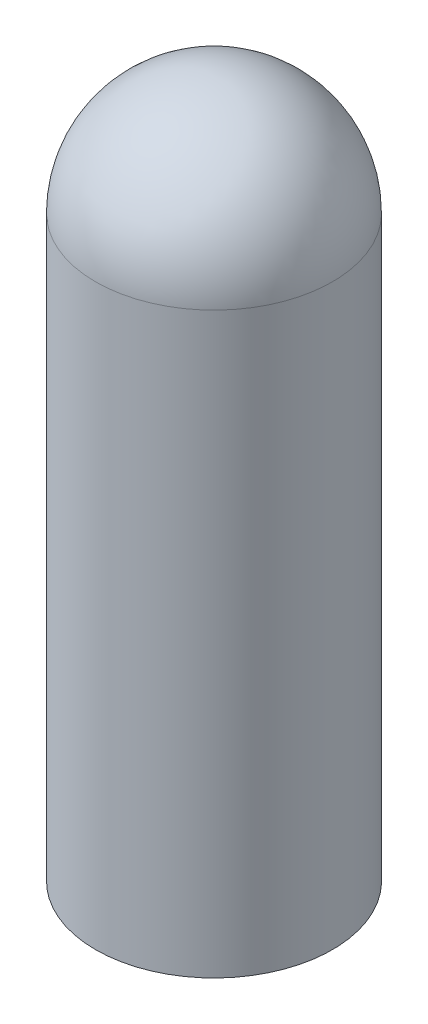
ISO-10303-21;
HEADER;
FILE_DESCRIPTION(('STEP AP214'),'2;1');
FILE_NAME('part.step','',(''),(''),'','','');
FILE_SCHEMA(('AUTOMOTIVE_DESIGN { 1 0 10303 214 1 1 1 1 }'));
ENDSEC;
DATA;
#1=APPLICATION_CONTEXT('core data for automotive mechanical design processes');
#2=APPLICATION_PROTOCOL_DEFINITION('international standard','automotive_design',2000,#1);
#3=PRODUCT_CONTEXT('',#1,'mechanical');
#4=PRODUCT('Part','Part','',(#3));
#5=PRODUCT_RELATED_PRODUCT_CATEGORY('part','',(#4));
#6=PRODUCT_DEFINITION_FORMATION('','',#4);
#7=PRODUCT_DEFINITION_CONTEXT('part definition',#1,'design');
#8=PRODUCT_DEFINITION('design','',#6,#7);
#9=PRODUCT_DEFINITION_SHAPE('','',#8);
#10=(LENGTH_UNIT() NAMED_UNIT(*) SI_UNIT(.MILLI.,.METRE.));
#11=(NAMED_UNIT(*) PLANE_ANGLE_UNIT() SI_UNIT($,.RADIAN.));
#12=(NAMED_UNIT(*) SI_UNIT($,.STERADIAN.) SOLID_ANGLE_UNIT());
#13=UNCERTAINTY_MEASURE_WITH_UNIT(LENGTH_MEASURE(1.E-05),#10,'distance_accuracy_value','');
#14=(GEOMETRIC_REPRESENTATION_CONTEXT(3) GLOBAL_UNCERTAINTY_ASSIGNED_CONTEXT((#13)) GLOBAL_UNIT_ASSIGNED_CONTEXT((#10,
#11,#12)) REPRESENTATION_CONTEXT('',''));
#15=CARTESIAN_POINT('',(0.,0.,0.));
#16=DIRECTION('',(0.,0.,1.));
#17=DIRECTION('',(1.,0.,0.));
#18=AXIS2_PLACEMENT_3D('',#15,#16,#17);
#19=CARTESIAN_POINT('',(0.,144.78,0.));
#20=DIRECTION('',(0.,-1.,0.));
#21=DIRECTION('',(0.,0.,-1.));
#22=AXIS2_PLACEMENT_3D('',#19,#20,#21);
#23=CYLINDRICAL_SURFACE('',#22,21.59);
#24=CARTESIAN_POINT('',(0.,123.19,0.));
#25=DIRECTION('',(0.,-1.,0.));
#26=DIRECTION('',(0.,0.,-1.));
#27=AXIS2_PLACEMENT_3D('',#24,#25,#26);
#28=CIRCLE('',#27,21.59);
#29=CARTESIAN_POINT('',(0.,123.19,-21.59));
#30=VERTEX_POINT('',#29);
#31=EDGE_CURVE('E44',#30,#30,#28,.T.);
#32=ORIENTED_EDGE('',*,*,#31,.T.);
#33=EDGE_LOOP('',(#32));
#34=FACE_BOUND('',#33,.T.);
#35=CARTESIAN_POINT('',(0.,17.78,0.));
#36=DIRECTION('',(0.,-1.,0.));
#37=DIRECTION('',(0.,0.,-1.));
#38=AXIS2_PLACEMENT_3D('',#35,#36,#37);
#39=CIRCLE('',#38,21.59);
#40=CARTESIAN_POINT('',(0.,17.78,-21.59));
#41=VERTEX_POINT('',#40);
#42=EDGE_CURVE('E50',#41,#41,#39,.T.);
#43=ORIENTED_EDGE('',*,*,#42,.F.);
#44=EDGE_LOOP('',(#43));
#45=FACE_BOUND('',#44,.T.);
#46=ADVANCED_FACE('F36',(#34,#45),#23,.T.);
#47=CARTESIAN_POINT('',(0.,123.19,0.));
#48=DIRECTION('',(0.,1.,0.));
#49=DIRECTION('',(0.,0.,1.));
#50=AXIS2_PLACEMENT_3D('',#47,#48,#49);
#51=SPHERICAL_SURFACE('',#50,21.59);
#52=ORIENTED_EDGE('',*,*,#31,.F.);
#53=EDGE_LOOP('',(#52));
#54=FACE_BOUND('',#53,.T.);
#55=ADVANCED_FACE('F69',(#54),#51,.T.);
#56=CARTESIAN_POINT('',(0.,17.78,0.));
#57=DIRECTION('',(0.,-1.,0.));
#58=DIRECTION('',(0.,0.,-1.));
#59=AXIS2_PLACEMENT_3D('',#56,#57,#58);
#60=PLANE('',#59);
#61=ORIENTED_EDGE('',*,*,#42,.T.);
#62=EDGE_LOOP('',(#61));
#63=FACE_BOUND('',#62,.T.);
#64=CARTESIAN_POINT('',(0.,17.78,0.));
#65=DIRECTION('',(0.,-1.,0.));
#66=DIRECTION('',(0.,0.,-1.));
#67=AXIS2_PLACEMENT_3D('',#64,#65,#66);
#68=CIRCLE('',#67,19.05);
#69=CARTESIAN_POINT('',(0.,17.78,-19.05));
#70=VERTEX_POINT('',#69);
#71=EDGE_CURVE('E40',#70,#70,#68,.F.);
#72=ORIENTED_EDGE('',*,*,#71,.T.);
#73=EDGE_LOOP('',(#72));
#74=FACE_BOUND('',#73,.T.);
#75=ADVANCED_FACE('F57',(#63,#74),#60,.T.);
#76=CARTESIAN_POINT('',(0.,120.65,0.));
#77=DIRECTION('',(0.,-1.,0.));
#78=DIRECTION('',(0.,0.,-1.));
#79=AXIS2_PLACEMENT_3D('',#76,#77,#78);
#80=SPHERICAL_SURFACE('',#79,19.05);
#81=CARTESIAN_POINT('',(0.,120.65,0.));
#82=DIRECTION('',(0.,-1.,0.));
#83=DIRECTION('',(0.,0.,-1.));
#84=AXIS2_PLACEMENT_3D('',#81,#82,#83);
#85=CIRCLE('',#84,19.05);
#86=CARTESIAN_POINT('',(0.,120.65,-19.05));
#87=VERTEX_POINT('',#86);
#88=EDGE_CURVE('E10',#87,#87,#85,.F.);
#89=ORIENTED_EDGE('',*,*,#88,.F.);
#90=EDGE_LOOP('',(#89));
#91=FACE_BOUND('',#90,.T.);
#92=ADVANCED_FACE('F38',(#91),#80,.F.);
#93=CARTESIAN_POINT('',(0.,139.7,0.));
#94=DIRECTION('',(0.,-1.,0.));
#95=DIRECTION('',(0.,0.,-1.));
#96=AXIS2_PLACEMENT_3D('',#93,#94,#95);
#97=CYLINDRICAL_SURFACE('',#96,19.05);
#98=ORIENTED_EDGE('',*,*,#88,.T.);
#99=EDGE_LOOP('',(#98));
#100=FACE_BOUND('',#99,.T.);
#101=ORIENTED_EDGE('',*,*,#71,.F.);
#102=EDGE_LOOP('',(#101));
#103=FACE_BOUND('',#102,.T.);
#104=ADVANCED_FACE('F59',(#100,#103),#97,.F.);
#105=CLOSED_SHELL('',(#46,#55,#75,#92,#104));
#106=MANIFOLD_SOLID_BREP('B2',#105);
#107=ADVANCED_BREP_SHAPE_REPRESENTATION('',(#18,#106),#14);
#108=SHAPE_DEFINITION_REPRESENTATION(#9,#107);
ENDSEC;
END-ISO-10303-21;
